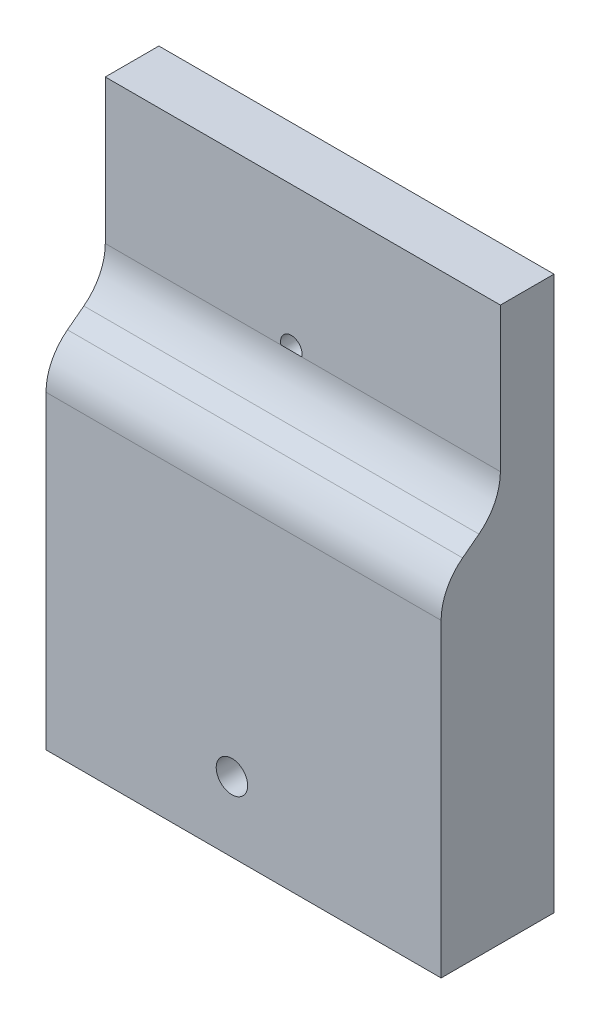
ISO-10303-21;
HEADER;
FILE_DESCRIPTION(('STEP AP214'),'2;1');
FILE_NAME('part.step','',(''),(''),'','','');
FILE_SCHEMA(('AUTOMOTIVE_DESIGN { 1 0 10303 214 1 1 1 1 }'));
ENDSEC;
DATA;
#1=APPLICATION_CONTEXT('core data for automotive mechanical design processes');
#2=APPLICATION_PROTOCOL_DEFINITION('international standard','automotive_design',2000,#1);
#3=PRODUCT_CONTEXT('',#1,'mechanical');
#4=PRODUCT('Part','Part','',(#3));
#5=PRODUCT_RELATED_PRODUCT_CATEGORY('part','',(#4));
#6=PRODUCT_DEFINITION_FORMATION('','',#4);
#7=PRODUCT_DEFINITION_CONTEXT('part definition',#1,'design');
#8=PRODUCT_DEFINITION('design','',#6,#7);
#9=PRODUCT_DEFINITION_SHAPE('','',#8);
#10=(LENGTH_UNIT() NAMED_UNIT(*) SI_UNIT(.MILLI.,.METRE.));
#11=(NAMED_UNIT(*) PLANE_ANGLE_UNIT() SI_UNIT($,.RADIAN.));
#12=(NAMED_UNIT(*) SI_UNIT($,.STERADIAN.) SOLID_ANGLE_UNIT());
#13=UNCERTAINTY_MEASURE_WITH_UNIT(LENGTH_MEASURE(1.E-05),#10,'distance_accuracy_value','');
#14=(GEOMETRIC_REPRESENTATION_CONTEXT(3) GLOBAL_UNCERTAINTY_ASSIGNED_CONTEXT((#13)) GLOBAL_UNIT_ASSIGNED_CONTEXT((#10,
#11,#12)) REPRESENTATION_CONTEXT('',''));
#15=CARTESIAN_POINT('',(0.,0.,0.));
#16=DIRECTION('',(0.,0.,1.));
#17=DIRECTION('',(1.,0.,0.));
#18=AXIS2_PLACEMENT_3D('',#15,#16,#17);
#19=CARTESIAN_POINT('',(-110.657526017008,91.9889897935392,127.388211114032));
#20=DIRECTION('',(0.,-1.,0.));
#21=DIRECTION('',(0.,0.,-1.));
#22=AXIS2_PLACEMENT_3D('',#19,#20,#21);
#23=PLANE('',#22);
#24=DIRECTION('',(-1.,0.,0.));
#25=VECTOR('',#24,1.);
#26=CARTESIAN_POINT('',(-6.89196140464962,91.9889897935392,8.61368022259039));
#27=LINE('',#26,#25);
#28=CARTESIAN_POINT('',(-47.1575260170082,91.9889897935392,8.61368022259039));
#29=VERTEX_POINT('',#28);
#30=CARTESIAN_POINT('',(-110.657526017008,91.9889897935392,8.61368022259039));
#31=VERTEX_POINT('',#30);
#32=EDGE_CURVE('E130',#29,#31,#27,.T.);
#33=ORIENTED_EDGE('',*,*,#32,.F.);
#34=DIRECTION('',(0.,0.,-1.));
#35=VECTOR('',#34,1.);
#36=CARTESIAN_POINT('',(-47.1575260170082,91.9889897935392,127.388211114032));
#37=LINE('',#36,#35);
#38=CARTESIAN_POINT('',(-47.1575260170082,91.9889897935392,0.));
#39=VERTEX_POINT('',#38);
#40=EDGE_CURVE('E162',#29,#39,#37,.T.);
#41=ORIENTED_EDGE('',*,*,#40,.T.);
#42=DIRECTION('',(-1.,0.,0.));
#43=VECTOR('',#42,1.);
#44=CARTESIAN_POINT('',(-110.657526017008,91.9889897935392,0.));
#45=LINE('',#44,#43);
#46=CARTESIAN_POINT('',(-110.657526017008,91.9889897935392,0.));
#47=VERTEX_POINT('',#46);
#48=EDGE_CURVE('E157',#39,#47,#45,.T.);
#49=ORIENTED_EDGE('',*,*,#48,.T.);
#50=DIRECTION('',(0.,0.,-1.));
#51=VECTOR('',#50,1.);
#52=CARTESIAN_POINT('',(-110.657526017008,91.9889897935392,127.388211114032));
#53=LINE('',#52,#51);
#54=EDGE_CURVE('E160',#31,#47,#53,.T.);
#55=ORIENTED_EDGE('',*,*,#54,.F.);
#56=EDGE_LOOP('',(#33,#41,#49,#55));
#57=FACE_BOUND('',#56,.T.);
#58=ADVANCED_FACE('F35',(#57),#23,.F.);
#59=CARTESIAN_POINT('',(-47.1575260170082,3.08898979353921,127.388211114032));
#60=DIRECTION('',(-1.,0.,0.));
#61=DIRECTION('',(0.,0.,1.));
#62=AXIS2_PLACEMENT_3D('',#59,#60,#61);
#63=PLANE('',#62);
#64=CARTESIAN_POINT('',(-47.1575260170082,52.8662333907495,9.37568022259041));
#65=DIRECTION('',(-1.,0.,0.));
#66=DIRECTION('',(0.,0.,1.));
#67=AXIS2_PLACEMENT_3D('',#64,#65,#66);
#68=CIRCLE('',#67,8.763);
#69=CARTESIAN_POINT('',(-47.1575260170082,59.8340415491134,14.6897952447025));
#70=VERTEX_POINT('',#69);
#71=CARTESIAN_POINT('',(-47.1575260170082,52.8662333907495,18.1386802225904));
#72=VERTEX_POINT('',#71);
#73=EDGE_CURVE('E151',#70,#72,#68,.F.);
#74=ORIENTED_EDGE('',*,*,#73,.T.);
#75=DIRECTION('',(0.,-1.,0.));
#76=VECTOR('',#75,1.);
#77=CARTESIAN_POINT('',(-47.1575260170082,3.08898979353921,18.1386802225904));
#78=LINE('',#77,#76);
#79=CARTESIAN_POINT('',(-47.1575260170082,3.08898979353921,18.1386802225904));
#80=VERTEX_POINT('',#79);
#81=EDGE_CURVE('E143',#72,#80,#78,.T.);
#82=ORIENTED_EDGE('',*,*,#81,.T.);
#83=DIRECTION('',(0.,0.,-1.));
#84=VECTOR('',#83,1.);
#85=CARTESIAN_POINT('',(-47.1575260170082,3.08898979353921,127.388211114032));
#86=LINE('',#85,#84);
#87=CARTESIAN_POINT('',(-47.1575260170082,3.08898979353921,0.));
#88=VERTEX_POINT('',#87);
#89=EDGE_CURVE('E163',#80,#88,#86,.T.);
#90=ORIENTED_EDGE('',*,*,#89,.T.);
#91=DIRECTION('',(0.,1.,0.));
#92=VECTOR('',#91,1.);
#93=CARTESIAN_POINT('',(-47.1575260170082,3.08898979353921,0.));
#94=LINE('',#93,#92);
#95=EDGE_CURVE('E154',#88,#39,#94,.T.);
#96=ORIENTED_EDGE('',*,*,#95,.T.);
#97=ORIENTED_EDGE('',*,*,#40,.F.);
#98=DIRECTION('',(0.,-1.,0.));
#99=VECTOR('',#98,1.);
#100=CARTESIAN_POINT('',(-47.1575260170082,0.,8.61368022259041));
#101=LINE('',#100,#99);
#102=CARTESIAN_POINT('',(-47.1575260170082,68.8055504878724,8.61368022259039));
#103=VERTEX_POINT('',#102);
#104=EDGE_CURVE('E245',#29,#103,#101,.T.);
#105=ORIENTED_EDGE('',*,*,#104,.T.);
#106=CARTESIAN_POINT('',(-47.1575260170082,68.8055504878723,17.3766802225904));
#107=DIRECTION('',(-1.,0.,0.));
#108=DIRECTION('',(0.,0.,1.));
#109=AXIS2_PLACEMENT_3D('',#106,#107,#108);
#110=CIRCLE('',#109,8.763);
#111=CARTESIAN_POINT('',(-47.1575260170082,61.8377423295085,12.0625652004783));
#112=VERTEX_POINT('',#111);
#113=EDGE_CURVE('E247',#112,#103,#110,.F.);
#114=ORIENTED_EDGE('',*,*,#113,.F.);
#115=DIRECTION('',(0.,0.606426454651622,-0.795139582148106));
#116=VECTOR('',#115,1.);
#117=CARTESIAN_POINT('',(-47.1575260170082,44.9132169751886,34.2538134797438));
#118=LINE('',#117,#116);
#119=EDGE_CURVE('E250',#70,#112,#118,.T.);
#120=ORIENTED_EDGE('',*,*,#119,.F.);
#121=EDGE_LOOP('',(#74,#82,#90,#96,#97,#105,#114,#120));
#122=FACE_BOUND('',#121,.T.);
#123=ADVANCED_FACE('F183',(#122),#63,.F.);
#124=CARTESIAN_POINT('',(-110.657526017008,3.08898979353921,127.388211114032));
#125=DIRECTION('',(1.,0.,0.));
#126=DIRECTION('',(0.,0.,-1.));
#127=AXIS2_PLACEMENT_3D('',#124,#125,#126);
#128=PLANE('',#127);
#129=CARTESIAN_POINT('',(-110.657526017008,52.8662333907495,9.37568022259041));
#130=DIRECTION('',(-1.,0.,0.));
#131=DIRECTION('',(0.,0.,1.));
#132=AXIS2_PLACEMENT_3D('',#129,#130,#131);
#133=CIRCLE('',#132,8.763);
#134=CARTESIAN_POINT('',(-110.657526017008,52.8662333907495,18.1386802225904));
#135=VERTEX_POINT('',#134);
#136=CARTESIAN_POINT('',(-110.657526017008,59.8340415491134,14.6897952447025));
#137=VERTEX_POINT('',#136);
#138=EDGE_CURVE('E59',#135,#137,#133,.T.);
#139=ORIENTED_EDGE('',*,*,#138,.T.);
#140=DIRECTION('',(0.,-0.606426454651622,0.795139582148106));
#141=VECTOR('',#140,1.);
#142=CARTESIAN_POINT('',(-110.657526017008,44.9132169751886,34.2538134797438));
#143=LINE('',#142,#141);
#144=CARTESIAN_POINT('',(-110.657526017008,61.8377423295085,12.0625652004783));
#145=VERTEX_POINT('',#144);
#146=EDGE_CURVE('E142',#145,#137,#143,.T.);
#147=ORIENTED_EDGE('',*,*,#146,.F.);
#148=CARTESIAN_POINT('',(-110.657526017008,68.8055504878723,17.3766802225904));
#149=DIRECTION('',(-1.,0.,0.));
#150=DIRECTION('',(0.,0.,1.));
#151=AXIS2_PLACEMENT_3D('',#148,#149,#150);
#152=CIRCLE('',#151,8.763);
#153=CARTESIAN_POINT('',(-110.657526017008,68.8055504878724,8.61368022259039));
#154=VERTEX_POINT('',#153);
#155=EDGE_CURVE('E255',#154,#145,#152,.T.);
#156=ORIENTED_EDGE('',*,*,#155,.F.);
#157=DIRECTION('',(0.,1.,0.));
#158=VECTOR('',#157,1.);
#159=CARTESIAN_POINT('',(-110.657526017008,0.,8.61368022259041));
#160=LINE('',#159,#158);
#161=EDGE_CURVE('E126',#154,#31,#160,.T.);
#162=ORIENTED_EDGE('',*,*,#161,.T.);
#163=ORIENTED_EDGE('',*,*,#54,.T.);
#164=DIRECTION('',(0.,-1.,0.));
#165=VECTOR('',#164,1.);
#166=CARTESIAN_POINT('',(-110.657526017008,3.08898979353921,0.));
#167=LINE('',#166,#165);
#168=CARTESIAN_POINT('',(-110.657526017008,3.08898979353921,0.));
#169=VERTEX_POINT('',#168);
#170=EDGE_CURVE('E147',#47,#169,#167,.T.);
#171=ORIENTED_EDGE('',*,*,#170,.T.);
#172=DIRECTION('',(0.,0.,-1.));
#173=VECTOR('',#172,1.);
#174=CARTESIAN_POINT('',(-110.657526017008,3.08898979353921,127.388211114032));
#175=LINE('',#174,#173);
#176=CARTESIAN_POINT('',(-110.657526017008,3.08898979353921,18.1386802225904));
#177=VERTEX_POINT('',#176);
#178=EDGE_CURVE('E39',#177,#169,#175,.T.);
#179=ORIENTED_EDGE('',*,*,#178,.F.);
#180=DIRECTION('',(0.,1.,0.));
#181=VECTOR('',#180,1.);
#182=CARTESIAN_POINT('',(-110.657526017008,3.08898979353921,18.1386802225904));
#183=LINE('',#182,#181);
#184=EDGE_CURVE('E11',#177,#135,#183,.T.);
#185=ORIENTED_EDGE('',*,*,#184,.T.);
#186=EDGE_LOOP('',(#139,#147,#156,#162,#163,#171,#179,#185));
#187=FACE_BOUND('',#186,.T.);
#188=ADVANCED_FACE('F37',(#187),#128,.F.);
#189=CARTESIAN_POINT('',(0.,0.,0.));
#190=DIRECTION('',(0.,0.,-1.));
#191=DIRECTION('',(-1.,0.,0.));
#192=AXIS2_PLACEMENT_3D('',#189,#190,#191);
#193=PLANE('',#192);
#194=CARTESIAN_POINT('',(-80.7774402388442,14.3157919393105,0.));
#195=DIRECTION('',(0.,0.,1.));
#196=DIRECTION('',(1.,0.,0.));
#197=AXIS2_PLACEMENT_3D('',#194,#195,#196);
#198=CIRCLE('',#197,2.5273);
#199=CARTESIAN_POINT('',(-78.2501402388442,14.3157919393105,0.));
#200=VERTEX_POINT('',#199);
#201=EDGE_CURVE('E114',#200,#200,#198,.T.);
#202=ORIENTED_EDGE('',*,*,#201,.T.);
#203=EDGE_LOOP('',(#202));
#204=FACE_BOUND('',#203,.T.);
#205=CARTESIAN_POINT('',(-80.7647402388439,69.2432919393109,0.));
#206=DIRECTION('',(0.,0.,1.));
#207=DIRECTION('',(1.,0.,0.));
#208=AXIS2_PLACEMENT_3D('',#205,#206,#207);
#209=CIRCLE('',#208,1.7272);
#210=CARTESIAN_POINT('',(-79.0375402388439,69.2432919393109,0.));
#211=VERTEX_POINT('',#210);
#212=EDGE_CURVE('E120',#211,#211,#209,.T.);
#213=ORIENTED_EDGE('',*,*,#212,.T.);
#214=EDGE_LOOP('',(#213));
#215=FACE_BOUND('',#214,.T.);
#216=ORIENTED_EDGE('',*,*,#170,.F.);
#217=ORIENTED_EDGE('',*,*,#48,.F.);
#218=ORIENTED_EDGE('',*,*,#95,.F.);
#219=DIRECTION('',(1.,0.,0.));
#220=VECTOR('',#219,1.);
#221=CARTESIAN_POINT('',(-110.657526017008,3.08898979353921,0.));
#222=LINE('',#221,#220);
#223=EDGE_CURVE('E150',#169,#88,#222,.T.);
#224=ORIENTED_EDGE('',*,*,#223,.F.);
#225=EDGE_LOOP('',(#216,#217,#218,#224));
#226=FACE_BOUND('',#225,.T.);
#227=ADVANCED_FACE('F175',(#204,#215,#226),#193,.T.);
#228=CARTESIAN_POINT('',(-110.657526017008,3.08898979353921,127.388211114032));
#229=DIRECTION('',(0.,1.,0.));
#230=DIRECTION('',(0.,0.,1.));
#231=AXIS2_PLACEMENT_3D('',#228,#229,#230);
#232=PLANE('',#231);
#233=ORIENTED_EDGE('',*,*,#89,.F.);
#234=DIRECTION('',(-1.,0.,0.));
#235=VECTOR('',#234,1.);
#236=CARTESIAN_POINT('',(-110.657526017008,3.08898979353921,18.1386802225904));
#237=LINE('',#236,#235);
#238=EDGE_CURVE('E44',#80,#177,#237,.T.);
#239=ORIENTED_EDGE('',*,*,#238,.T.);
#240=ORIENTED_EDGE('',*,*,#178,.T.);
#241=ORIENTED_EDGE('',*,*,#223,.T.);
#242=EDGE_LOOP('',(#233,#239,#240,#241));
#243=FACE_BOUND('',#242,.T.);
#244=ADVANCED_FACE('F169',(#243),#232,.F.);
#245=CARTESIAN_POINT('',(-88.7149402388439,36.167768798815,18.1386802225904));
#246=DIRECTION('',(0.,0.,-1.));
#247=DIRECTION('',(-1.,0.,0.));
#248=AXIS2_PLACEMENT_3D('',#245,#246,#247);
#249=PLANE('',#248);
#250=CARTESIAN_POINT('',(-80.7774402388442,14.3157919393105,18.1386802225904));
#251=DIRECTION('',(0.,0.,1.));
#252=DIRECTION('',(1.,0.,0.));
#253=AXIS2_PLACEMENT_3D('',#250,#251,#252);
#254=CIRCLE('',#253,2.52729999999998);
#255=CARTESIAN_POINT('',(-78.2501402388442,14.3157919393105,18.1386802225904));
#256=VERTEX_POINT('',#255);
#257=EDGE_CURVE('E237',#256,#256,#254,.T.);
#258=ORIENTED_EDGE('',*,*,#257,.F.);
#259=EDGE_LOOP('',(#258));
#260=FACE_BOUND('',#259,.T.);
#261=ORIENTED_EDGE('',*,*,#81,.F.);
#262=DIRECTION('',(-1.,0.,0.));
#263=VECTOR('',#262,1.);
#264=CARTESIAN_POINT('',(-6.89196140464962,52.8662333907495,18.1386802225904));
#265=LINE('',#264,#263);
#266=EDGE_CURVE('E139',#72,#135,#265,.T.);
#267=ORIENTED_EDGE('',*,*,#266,.T.);
#268=ORIENTED_EDGE('',*,*,#184,.F.);
#269=ORIENTED_EDGE('',*,*,#238,.F.);
#270=EDGE_LOOP('',(#261,#267,#268,#269));
#271=FACE_BOUND('',#270,.T.);
#272=ADVANCED_FACE('F195',(#260,#271),#249,.F.);
#273=CARTESIAN_POINT('',(-6.89196140464962,52.8662333907495,9.37568022259041));
#274=DIRECTION('',(-1.,0.,0.));
#275=DIRECTION('',(0.,0.,1.));
#276=AXIS2_PLACEMENT_3D('',#273,#274,#275);
#277=CYLINDRICAL_SURFACE('',#276,8.763);
#278=DIRECTION('',(-1.,0.,0.));
#279=VECTOR('',#278,1.);
#280=CARTESIAN_POINT('',(-6.89196140464962,59.8340415491134,14.6897952447025));
#281=LINE('',#280,#279);
#282=EDGE_CURVE('E248',#70,#137,#281,.T.);
#283=ORIENTED_EDGE('',*,*,#282,.T.);
#284=ORIENTED_EDGE('',*,*,#138,.F.);
#285=ORIENTED_EDGE('',*,*,#266,.F.);
#286=ORIENTED_EDGE('',*,*,#73,.F.);
#287=EDGE_LOOP('',(#283,#284,#285,#286));
#288=FACE_BOUND('',#287,.T.);
#289=ADVANCED_FACE('F200',(#288),#277,.T.);
#290=CARTESIAN_POINT('',(-6.89196140464962,44.9132169751886,34.2538134797438));
#291=DIRECTION('',(0.,-0.795139582148105,-0.606426454651622));
#292=DIRECTION('',(0.,0.606426454651622,-0.795139582148106));
#293=AXIS2_PLACEMENT_3D('',#290,#291,#292);
#294=PLANE('',#293);
#295=ORIENTED_EDGE('',*,*,#119,.T.);
#296=DIRECTION('',(-1.,0.,0.));
#297=VECTOR('',#296,1.);
#298=CARTESIAN_POINT('',(-6.89196140464962,61.8377423295085,12.0625652004783));
#299=LINE('',#298,#297);
#300=EDGE_CURVE('E134',#112,#145,#299,.T.);
#301=ORIENTED_EDGE('',*,*,#300,.T.);
#302=ORIENTED_EDGE('',*,*,#146,.T.);
#303=ORIENTED_EDGE('',*,*,#282,.F.);
#304=EDGE_LOOP('',(#295,#301,#302,#303));
#305=FACE_BOUND('',#304,.T.);
#306=ADVANCED_FACE('F211',(#305),#294,.F.);
#307=CARTESIAN_POINT('',(-6.89196140464962,68.8055504878723,17.3766802225904));
#308=DIRECTION('',(-1.,0.,0.));
#309=DIRECTION('',(0.,0.,1.));
#310=AXIS2_PLACEMENT_3D('',#307,#308,#309);
#311=CYLINDRICAL_SURFACE('',#310,8.763);
#312=ORIENTED_EDGE('',*,*,#113,.T.);
#313=DIRECTION('',(-1.,0.,0.));
#314=VECTOR('',#313,1.);
#315=CARTESIAN_POINT('',(-6.89196140464962,68.8055504878724,8.61368022259039));
#316=LINE('',#315,#314);
#317=CARTESIAN_POINT('',(-79.0939313743437,68.8055504878724,8.61368022259039));
#318=VERTEX_POINT('',#317);
#319=EDGE_CURVE('E132',#103,#318,#316,.T.);
#320=ORIENTED_EDGE('',*,*,#319,.T.);
#321=CARTESIAN_POINT('',(-82.4355491033441,68.8055504878723,8.61368022259041));
#322=VERTEX_POINT('',#321);
#323=EDGE_CURVE('E119',#318,#322,#316,.T.);
#324=ORIENTED_EDGE('',*,*,#323,.T.);
#325=EDGE_CURVE('E122',#322,#154,#316,.T.);
#326=ORIENTED_EDGE('',*,*,#325,.T.);
#327=ORIENTED_EDGE('',*,*,#155,.T.);
#328=ORIENTED_EDGE('',*,*,#300,.F.);
#329=EDGE_LOOP('',(#312,#320,#324,#326,#327,#328));
#330=FACE_BOUND('',#329,.T.);
#331=ADVANCED_FACE('F133',(#330),#311,.F.);
#332=CARTESIAN_POINT('',(-6.89196140464962,0.,8.61368022259041));
#333=DIRECTION('',(0.,0.,1.));
#334=DIRECTION('',(0.,-1.,0.));
#335=AXIS2_PLACEMENT_3D('',#332,#333,#334);
#336=PLANE('',#335);
#337=CARTESIAN_POINT('',(-80.7647402388439,69.2432919393109,8.61368022259041));
#338=DIRECTION('',(0.,0.,1.));
#339=DIRECTION('',(1.,0.,0.));
#340=AXIS2_PLACEMENT_3D('',#337,#338,#339);
#341=CIRCLE('',#340,1.72719999999998);
#342=EDGE_CURVE('E106',#318,#322,#341,.T.);
#343=ORIENTED_EDGE('',*,*,#342,.F.);
#344=ORIENTED_EDGE('',*,*,#319,.F.);
#345=ORIENTED_EDGE('',*,*,#104,.F.);
#346=ORIENTED_EDGE('',*,*,#32,.T.);
#347=ORIENTED_EDGE('',*,*,#161,.F.);
#348=ORIENTED_EDGE('',*,*,#325,.F.);
#349=EDGE_LOOP('',(#343,#344,#345,#346,#347,#348));
#350=FACE_BOUND('',#349,.T.);
#351=ADVANCED_FACE('F124',(#350),#336,.T.);
#352=CARTESIAN_POINT('',(-79.0375402388439,69.2432919393109,8.61368022259041));
#353=DIRECTION('',(0.,0.,1.));
#354=DIRECTION('',(1.,0.,0.));
#355=AXIS2_PLACEMENT_3D('',#352,#353,#354);
#356=PLANE('',#355);
#357=ORIENTED_EDGE('',*,*,#323,.F.);
#358=EDGE_CURVE('E51',#322,#318,#341,.T.);
#359=ORIENTED_EDGE('',*,*,#358,.F.);
#360=EDGE_LOOP('',(#357,#359));
#361=FACE_BOUND('',#360,.T.);
#362=ADVANCED_FACE('F117',(#361),#356,.F.);
#363=CARTESIAN_POINT('',(-80.7647402388439,69.2432919393109,8.61368022259041));
#364=DIRECTION('',(0.,0.,1.));
#365=DIRECTION('',(1.,0.,0.));
#366=AXIS2_PLACEMENT_3D('',#363,#364,#365);
#367=CYLINDRICAL_SURFACE('',#366,1.72719999999999);
#368=ORIENTED_EDGE('',*,*,#212,.F.);
#369=EDGE_LOOP('',(#368));
#370=FACE_BOUND('',#369,.T.);
#371=ORIENTED_EDGE('',*,*,#358,.T.);
#372=ORIENTED_EDGE('',*,*,#342,.T.);
#373=EDGE_LOOP('',(#371,#372));
#374=FACE_BOUND('',#373,.T.);
#375=ADVANCED_FACE('F108',(#370,#374),#367,.F.);
#376=CARTESIAN_POINT('',(-80.7774402388442,14.3157919393105,18.1386802225904));
#377=DIRECTION('',(0.,0.,1.));
#378=DIRECTION('',(1.,0.,0.));
#379=AXIS2_PLACEMENT_3D('',#376,#377,#378);
#380=CYLINDRICAL_SURFACE('',#379,2.52729999999999);
#381=ORIENTED_EDGE('',*,*,#201,.F.);
#382=EDGE_LOOP('',(#381));
#383=FACE_BOUND('',#382,.T.);
#384=ORIENTED_EDGE('',*,*,#257,.T.);
#385=EDGE_LOOP('',(#384));
#386=FACE_BOUND('',#385,.T.);
#387=ADVANCED_FACE('F223',(#383,#386),#380,.F.);
#388=CLOSED_SHELL('',(#58,#123,#188,#227,#244,#272,#289,#306,#331,#351,#362,#375,#387));
#389=MANIFOLD_SOLID_BREP('B2',#388);
#390=ADVANCED_BREP_SHAPE_REPRESENTATION('',(#18,#389),#14);
#391=SHAPE_DEFINITION_REPRESENTATION(#9,#390);
ENDSEC;
END-ISO-10303-21;
